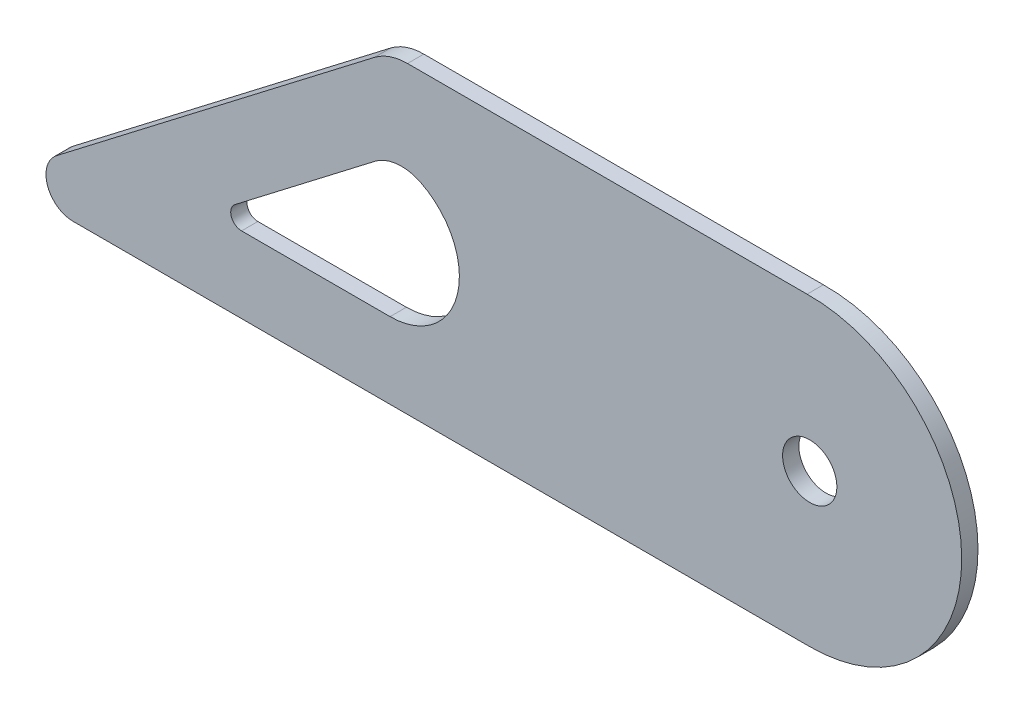
ISO-10303-21;
HEADER;
FILE_DESCRIPTION(('STEP AP214'),'2;1');
FILE_NAME('part.step','',(''),(''),'','','');
FILE_SCHEMA(('AUTOMOTIVE_DESIGN { 1 0 10303 214 1 1 1 1 }'));
ENDSEC;
DATA;
#1=APPLICATION_CONTEXT('core data for automotive mechanical design processes');
#2=APPLICATION_PROTOCOL_DEFINITION('international standard','automotive_design',2000,#1);
#3=PRODUCT_CONTEXT('',#1,'mechanical');
#4=PRODUCT('Part','Part','',(#3));
#5=PRODUCT_RELATED_PRODUCT_CATEGORY('part','',(#4));
#6=PRODUCT_DEFINITION_FORMATION('','',#4);
#7=PRODUCT_DEFINITION_CONTEXT('part definition',#1,'design');
#8=PRODUCT_DEFINITION('design','',#6,#7);
#9=PRODUCT_DEFINITION_SHAPE('','',#8);
#10=(LENGTH_UNIT() NAMED_UNIT(*) SI_UNIT(.MILLI.,.METRE.));
#11=(NAMED_UNIT(*) PLANE_ANGLE_UNIT() SI_UNIT($,.RADIAN.));
#12=(NAMED_UNIT(*) SI_UNIT($,.STERADIAN.) SOLID_ANGLE_UNIT());
#13=UNCERTAINTY_MEASURE_WITH_UNIT(LENGTH_MEASURE(1.E-05),#10,'distance_accuracy_value','');
#14=(GEOMETRIC_REPRESENTATION_CONTEXT(3) GLOBAL_UNCERTAINTY_ASSIGNED_CONTEXT((#13)) GLOBAL_UNIT_ASSIGNED_CONTEXT((#10,
#11,#12)) REPRESENTATION_CONTEXT('',''));
#15=CARTESIAN_POINT('',(0.,0.,0.));
#16=DIRECTION('',(0.,0.,1.));
#17=DIRECTION('',(1.,0.,0.));
#18=AXIS2_PLACEMENT_3D('',#15,#16,#17);
#19=CARTESIAN_POINT('',(2.43296484318195,-139.978857982453,7.5));
#20=DIRECTION('',(0.,0.,1.));
#21=DIRECTION('',(1.,0.,0.));
#22=AXIS2_PLACEMENT_3D('',#19,#20,#21);
#23=PLANE('',#22);
#24=CARTESIAN_POINT('',(-373.655156631983,-124.759495379133,7.5));
#25=DIRECTION('',(0.,0.,1.));
#26=DIRECTION('',(-1.,0.,0.));
#27=AXIS2_PLACEMENT_3D('',#24,#25,#26);
#28=CIRCLE('',#27,40.);
#29=CARTESIAN_POINT('',(-356.115398821638,-88.8101296551813,7.5));
#30=VERTEX_POINT('',#29);
#31=CARTESIAN_POINT('',(-398.014187586916,-93.0319425120013,7.5));
#32=VERTEX_POINT('',#31);
#33=EDGE_CURVE('E138',#30,#32,#28,.T.);
#34=ORIENTED_EDGE('',*,*,#33,.F.);
#35=CARTESIAN_POINT('',(-384.098122953556,-146.163326583456,7.5));
#36=DIRECTION('',(0.,0.,1.));
#37=DIRECTION('',(-1.,0.,0.));
#38=AXIS2_PLACEMENT_3D('',#35,#36,#37);
#39=CIRCLE('',#38,63.8155313989976);
#40=CARTESIAN_POINT('',(-384.098122953556,-209.978857982453,7.5));
#41=VERTEX_POINT('',#40);
#42=EDGE_CURVE('E129',#41,#30,#39,.T.);
#43=ORIENTED_EDGE('',*,*,#42,.F.);
#44=DIRECTION('',(1.,0.,0.));
#45=VECTOR('',#44,1.);
#46=CARTESIAN_POINT('',(-384.098122953556,-209.978857982453,7.5));
#47=LINE('',#46,#45);
#48=CARTESIAN_POINT('',(-520.891157533021,-209.978857982453,7.5));
#49=VERTEX_POINT('',#48);
#50=EDGE_CURVE('E163',#49,#41,#47,.T.);
#51=ORIENTED_EDGE('',*,*,#50,.F.);
#52=CARTESIAN_POINT('',(-520.891157533021,-199.978857982453,7.5));
#53=DIRECTION('',(0.,0.,1.));
#54=DIRECTION('',(1.,0.,0.));
#55=AXIS2_PLACEMENT_3D('',#52,#53,#54);
#56=CIRCLE('',#55,10.);
#57=CARTESIAN_POINT('',(-526.980915271754,-192.04696976567,7.5));
#58=VERTEX_POINT('',#57);
#59=EDGE_CURVE('E157',#58,#49,#56,.T.);
#60=ORIENTED_EDGE('',*,*,#59,.F.);
#61=DIRECTION('',(-0.793188821678298,-0.608975773873307,0.));
#62=VECTOR('',#61,1.);
#63=CARTESIAN_POINT('',(-526.980915271754,-192.04696976567,7.5));
#64=LINE('',#63,#62);
#65=EDGE_CURVE('E153',#32,#58,#64,.T.);
#66=ORIENTED_EDGE('',*,*,#65,.F.);
#67=EDGE_LOOP('',(#34,#43,#51,#60,#66));
#68=FACE_BOUND('',#67,.T.);
#69=CARTESIAN_POINT('',(2.43296484318195,-139.978857982453,7.5));
#70=DIRECTION('',(0.,0.,1.));
#71=DIRECTION('',(1.,0.,0.));
#72=AXIS2_PLACEMENT_3D('',#69,#70,#71);
#73=CIRCLE('',#72,140.);
#74=CARTESIAN_POINT('',(2.43296484318199,-279.978857982453,7.5));
#75=VERTEX_POINT('',#74);
#76=CARTESIAN_POINT('',(0.,0.,7.5));
#77=VERTEX_POINT('',#76);
#78=EDGE_CURVE('E191',#75,#77,#73,.T.);
#79=ORIENTED_EDGE('',*,*,#78,.T.);
#80=DIRECTION('',(-1.,0.,0.));
#81=VECTOR('',#80,1.);
#82=CARTESIAN_POINT('',(-368.019753232034,0.,7.5));
#83=LINE('',#82,#81);
#84=CARTESIAN_POINT('',(-368.019753232034,0.,7.5));
#85=VERTEX_POINT('',#84);
#86=EDGE_CURVE('E195',#77,#85,#83,.T.);
#87=ORIENTED_EDGE('',*,*,#86,.T.);
#88=CARTESIAN_POINT('',(-368.019753232034,-49.9999999999824,7.5));
#89=DIRECTION('',(0.,0.,1.));
#90=DIRECTION('',(1.,0.,0.));
#91=AXIS2_PLACEMENT_3D('',#88,#89,#90);
#92=CIRCLE('',#91,49.9999999999824);
#93=CARTESIAN_POINT('',(-398.468541925689,-10.3405589160815,7.5));
#94=VERTEX_POINT('',#93);
#95=EDGE_CURVE('E199',#85,#94,#92,.T.);
#96=ORIENTED_EDGE('',*,*,#95,.T.);
#97=DIRECTION('',(-0.793188821678298,-0.608975773873308,0.));
#98=VECTOR('',#97,1.);
#99=CARTESIAN_POINT('',(-398.468541925689,-10.3405589160815,7.5));
#100=LINE('',#99,#98);
#101=CARTESIAN_POINT('',(-691.280931438002,-235.149137440496,7.5));
#102=VERTEX_POINT('',#101);
#103=EDGE_CURVE('E202',#94,#102,#100,.T.);
#104=ORIENTED_EDGE('',*,*,#103,.T.);
#105=CARTESIAN_POINT('',(-676.05653709117,-254.978857982453,7.5));
#106=DIRECTION('',(0.,0.,1.));
#107=DIRECTION('',(1.,0.,0.));
#108=AXIS2_PLACEMENT_3D('',#105,#106,#107);
#109=CIRCLE('',#108,25.);
#110=CARTESIAN_POINT('',(-676.056537091171,-279.978857982453,7.5));
#111=VERTEX_POINT('',#110);
#112=EDGE_CURVE('E205',#102,#111,#109,.T.);
#113=ORIENTED_EDGE('',*,*,#112,.T.);
#114=DIRECTION('',(1.,0.,0.));
#115=VECTOR('',#114,1.);
#116=CARTESIAN_POINT('',(2.43296484318199,-279.978857982453,7.5));
#117=LINE('',#116,#115);
#118=EDGE_CURVE('E208',#111,#75,#117,.T.);
#119=ORIENTED_EDGE('',*,*,#118,.T.);
#120=EDGE_LOOP('',(#79,#87,#96,#104,#113,#119));
#121=FACE_BOUND('',#120,.T.);
#122=CARTESIAN_POINT('',(2.43296484318195,-139.978857982453,7.5));
#123=DIRECTION('',(0.,0.,1.));
#124=DIRECTION('',(1.,0.,0.));
#125=AXIS2_PLACEMENT_3D('',#122,#123,#124);
#126=CIRCLE('',#125,25.);
#127=CARTESIAN_POINT('',(27.432964843182,-139.978857982453,7.5));
#128=VERTEX_POINT('',#127);
#129=EDGE_CURVE('E168',#128,#128,#126,.T.);
#130=ORIENTED_EDGE('',*,*,#129,.F.);
#131=EDGE_LOOP('',(#130));
#132=FACE_BOUND('',#131,.T.);
#133=ADVANCED_FACE('F45',(#68,#121,#132),#23,.T.);
#134=CARTESIAN_POINT('',(2.43296484318195,-139.978857982453,-7.5));
#135=DIRECTION('',(0.,0.,1.));
#136=DIRECTION('',(1.,0.,0.));
#137=AXIS2_PLACEMENT_3D('',#134,#135,#136);
#138=PLANE('',#137);
#139=CARTESIAN_POINT('',(2.43296484318195,-139.978857982453,-7.5));
#140=DIRECTION('',(0.,0.,1.));
#141=DIRECTION('',(1.,0.,0.));
#142=AXIS2_PLACEMENT_3D('',#139,#140,#141);
#143=CIRCLE('',#142,140.);
#144=CARTESIAN_POINT('',(2.43296484318199,-279.978857982453,-7.5));
#145=VERTEX_POINT('',#144);
#146=CARTESIAN_POINT('',(0.,0.,-7.5));
#147=VERTEX_POINT('',#146);
#148=EDGE_CURVE('E147',#145,#147,#143,.T.);
#149=ORIENTED_EDGE('',*,*,#148,.F.);
#150=DIRECTION('',(1.,0.,0.));
#151=VECTOR('',#150,1.);
#152=CARTESIAN_POINT('',(2.43296484318199,-279.978857982453,-7.5));
#153=LINE('',#152,#151);
#154=CARTESIAN_POINT('',(-676.056537091171,-279.978857982453,-7.5));
#155=VERTEX_POINT('',#154);
#156=EDGE_CURVE('E196',#155,#145,#153,.T.);
#157=ORIENTED_EDGE('',*,*,#156,.F.);
#158=CARTESIAN_POINT('',(-676.05653709117,-254.978857982453,-7.5));
#159=DIRECTION('',(0.,0.,1.));
#160=DIRECTION('',(1.,0.,0.));
#161=AXIS2_PLACEMENT_3D('',#158,#159,#160);
#162=CIRCLE('',#161,25.);
#163=CARTESIAN_POINT('',(-691.280931438002,-235.149137440496,-7.5));
#164=VERTEX_POINT('',#163);
#165=EDGE_CURVE('E224',#164,#155,#162,.T.);
#166=ORIENTED_EDGE('',*,*,#165,.F.);
#167=DIRECTION('',(-0.793188821678298,-0.608975773873308,0.));
#168=VECTOR('',#167,1.);
#169=CARTESIAN_POINT('',(-398.468541925689,-10.3405589160815,-7.5));
#170=LINE('',#169,#168);
#171=CARTESIAN_POINT('',(-398.468541925689,-10.3405589160815,-7.5));
#172=VERTEX_POINT('',#171);
#173=EDGE_CURVE('E221',#172,#164,#170,.T.);
#174=ORIENTED_EDGE('',*,*,#173,.F.);
#175=CARTESIAN_POINT('',(-368.019753232034,-49.9999999999824,-7.5));
#176=DIRECTION('',(0.,0.,1.));
#177=DIRECTION('',(1.,0.,0.));
#178=AXIS2_PLACEMENT_3D('',#175,#176,#177);
#179=CIRCLE('',#178,49.9999999999824);
#180=CARTESIAN_POINT('',(-368.019753232034,0.,-7.5));
#181=VERTEX_POINT('',#180);
#182=EDGE_CURVE('E218',#181,#172,#179,.T.);
#183=ORIENTED_EDGE('',*,*,#182,.F.);
#184=DIRECTION('',(-1.,0.,0.));
#185=VECTOR('',#184,1.);
#186=CARTESIAN_POINT('',(-368.019753232034,0.,-7.5));
#187=LINE('',#186,#185);
#188=EDGE_CURVE('E215',#147,#181,#187,.T.);
#189=ORIENTED_EDGE('',*,*,#188,.F.);
#190=EDGE_LOOP('',(#149,#157,#166,#174,#183,#189));
#191=FACE_BOUND('',#190,.T.);
#192=CARTESIAN_POINT('',(-384.098122953556,-146.163326583456,-7.5));
#193=DIRECTION('',(0.,0.,1.));
#194=DIRECTION('',(-1.,0.,0.));
#195=AXIS2_PLACEMENT_3D('',#192,#193,#194);
#196=CIRCLE('',#195,63.8155313989976);
#197=CARTESIAN_POINT('',(-384.098122953556,-209.978857982453,-7.5));
#198=VERTEX_POINT('',#197);
#199=CARTESIAN_POINT('',(-356.115398821638,-88.8101296551813,-7.5));
#200=VERTEX_POINT('',#199);
#201=EDGE_CURVE('E69',#198,#200,#196,.T.);
#202=ORIENTED_EDGE('',*,*,#201,.T.);
#203=CARTESIAN_POINT('',(-373.655156631983,-124.759495379133,-7.5));
#204=DIRECTION('',(0.,0.,1.));
#205=DIRECTION('',(-1.,0.,0.));
#206=AXIS2_PLACEMENT_3D('',#203,#204,#205);
#207=CIRCLE('',#206,40.);
#208=CARTESIAN_POINT('',(-398.014187586916,-93.0319425120013,-7.5));
#209=VERTEX_POINT('',#208);
#210=EDGE_CURVE('E145',#200,#209,#207,.T.);
#211=ORIENTED_EDGE('',*,*,#210,.T.);
#212=DIRECTION('',(-0.793188821678298,-0.608975773873307,0.));
#213=VECTOR('',#212,1.);
#214=CARTESIAN_POINT('',(-526.980915271754,-192.04696976567,-7.5));
#215=LINE('',#214,#213);
#216=CARTESIAN_POINT('',(-526.980915271754,-192.04696976567,-7.5));
#217=VERTEX_POINT('',#216);
#218=EDGE_CURVE('E171',#209,#217,#215,.T.);
#219=ORIENTED_EDGE('',*,*,#218,.T.);
#220=CARTESIAN_POINT('',(-520.891157533021,-199.978857982453,-7.5));
#221=DIRECTION('',(0.,0.,1.));
#222=DIRECTION('',(1.,0.,0.));
#223=AXIS2_PLACEMENT_3D('',#220,#221,#222);
#224=CIRCLE('',#223,10.);
#225=CARTESIAN_POINT('',(-520.891157533021,-209.978857982453,-7.5));
#226=VERTEX_POINT('',#225);
#227=EDGE_CURVE('E175',#217,#226,#224,.T.);
#228=ORIENTED_EDGE('',*,*,#227,.T.);
#229=DIRECTION('',(1.,0.,0.));
#230=VECTOR('',#229,1.);
#231=CARTESIAN_POINT('',(-384.098122953556,-209.978857982453,-7.5));
#232=LINE('',#231,#230);
#233=EDGE_CURVE('E139',#226,#198,#232,.T.);
#234=ORIENTED_EDGE('',*,*,#233,.T.);
#235=EDGE_LOOP('',(#202,#211,#219,#228,#234));
#236=FACE_BOUND('',#235,.T.);
#237=CARTESIAN_POINT('',(2.43296484318195,-139.978857982453,-7.5));
#238=DIRECTION('',(0.,0.,1.));
#239=DIRECTION('',(1.,0.,0.));
#240=AXIS2_PLACEMENT_3D('',#237,#238,#239);
#241=CIRCLE('',#240,25.);
#242=CARTESIAN_POINT('',(27.432964843182,-139.978857982453,-7.5));
#243=VERTEX_POINT('',#242);
#244=EDGE_CURVE('E314',#243,#243,#241,.T.);
#245=ORIENTED_EDGE('',*,*,#244,.T.);
#246=EDGE_LOOP('',(#245));
#247=FACE_BOUND('',#246,.T.);
#248=ADVANCED_FACE('F255',(#191,#236,#247),#138,.F.);
#249=CARTESIAN_POINT('',(2.43296484318195,-139.978857982453,7.5));
#250=DIRECTION('',(0.,0.,-1.));
#251=DIRECTION('',(-1.,0.,0.));
#252=AXIS2_PLACEMENT_3D('',#249,#250,#251);
#253=CYLINDRICAL_SURFACE('',#252,140.);
#254=ORIENTED_EDGE('',*,*,#148,.T.);
#255=DIRECTION('',(0.,0.,-1.));
#256=VECTOR('',#255,1.);
#257=CARTESIAN_POINT('',(0.,0.,7.5));
#258=LINE('',#257,#256);
#259=EDGE_CURVE('E11',#77,#147,#258,.T.);
#260=ORIENTED_EDGE('',*,*,#259,.F.);
#261=ORIENTED_EDGE('',*,*,#78,.F.);
#262=DIRECTION('',(0.,0.,-1.));
#263=VECTOR('',#262,1.);
#264=CARTESIAN_POINT('',(2.43296484318199,-279.978857982453,7.5));
#265=LINE('',#264,#263);
#266=EDGE_CURVE('E211',#75,#145,#265,.T.);
#267=ORIENTED_EDGE('',*,*,#266,.T.);
#268=EDGE_LOOP('',(#254,#260,#261,#267));
#269=FACE_BOUND('',#268,.T.);
#270=ADVANCED_FACE('F47',(#269),#253,.T.);
#271=CARTESIAN_POINT('',(-368.019753232034,0.,7.5));
#272=DIRECTION('',(0.,-1.,0.));
#273=DIRECTION('',(1.,0.,0.));
#274=AXIS2_PLACEMENT_3D('',#271,#272,#273);
#275=PLANE('',#274);
#276=ORIENTED_EDGE('',*,*,#188,.T.);
#277=DIRECTION('',(0.,0.,-1.));
#278=VECTOR('',#277,1.);
#279=CARTESIAN_POINT('',(-368.019753232034,0.,7.5));
#280=LINE('',#279,#278);
#281=EDGE_CURVE('E54',#85,#181,#280,.T.);
#282=ORIENTED_EDGE('',*,*,#281,.F.);
#283=ORIENTED_EDGE('',*,*,#86,.F.);
#284=ORIENTED_EDGE('',*,*,#259,.T.);
#285=EDGE_LOOP('',(#276,#282,#283,#284));
#286=FACE_BOUND('',#285,.T.);
#287=ADVANCED_FACE('F272',(#286),#275,.F.);
#288=CARTESIAN_POINT('',(-368.019753232034,-49.9999999999824,7.5));
#289=DIRECTION('',(0.,0.,-1.));
#290=DIRECTION('',(-1.,0.,0.));
#291=AXIS2_PLACEMENT_3D('',#288,#289,#290);
#292=CYLINDRICAL_SURFACE('',#291,49.9999999999824);
#293=ORIENTED_EDGE('',*,*,#182,.T.);
#294=DIRECTION('',(0.,0.,-1.));
#295=VECTOR('',#294,1.);
#296=CARTESIAN_POINT('',(-398.468541925689,-10.3405589160815,7.5));
#297=LINE('',#296,#295);
#298=EDGE_CURVE('E240',#94,#172,#297,.T.);
#299=ORIENTED_EDGE('',*,*,#298,.F.);
#300=ORIENTED_EDGE('',*,*,#95,.F.);
#301=ORIENTED_EDGE('',*,*,#281,.T.);
#302=EDGE_LOOP('',(#293,#299,#300,#301));
#303=FACE_BOUND('',#302,.T.);
#304=ADVANCED_FACE('F249',(#303),#292,.T.);
#305=CARTESIAN_POINT('',(-398.468541925689,-10.3405589160815,7.5));
#306=DIRECTION('',(0.608975773873308,-0.793188821678298,0.));
#307=DIRECTION('',(0.793188821678298,0.608975773873308,0.));
#308=AXIS2_PLACEMENT_3D('',#305,#306,#307);
#309=PLANE('',#308);
#310=ORIENTED_EDGE('',*,*,#173,.T.);
#311=DIRECTION('',(0.,0.,-1.));
#312=VECTOR('',#311,1.);
#313=CARTESIAN_POINT('',(-691.280931438002,-235.149137440496,7.5));
#314=LINE('',#313,#312);
#315=EDGE_CURVE('E236',#102,#164,#314,.T.);
#316=ORIENTED_EDGE('',*,*,#315,.F.);
#317=ORIENTED_EDGE('',*,*,#103,.F.);
#318=ORIENTED_EDGE('',*,*,#298,.T.);
#319=EDGE_LOOP('',(#310,#316,#317,#318));
#320=FACE_BOUND('',#319,.T.);
#321=ADVANCED_FACE('F261',(#320),#309,.F.);
#322=CARTESIAN_POINT('',(-676.05653709117,-254.978857982453,7.5));
#323=DIRECTION('',(0.,0.,-1.));
#324=DIRECTION('',(-1.,0.,0.));
#325=AXIS2_PLACEMENT_3D('',#322,#323,#324);
#326=CYLINDRICAL_SURFACE('',#325,25.);
#327=ORIENTED_EDGE('',*,*,#165,.T.);
#328=DIRECTION('',(0.,0.,-1.));
#329=VECTOR('',#328,1.);
#330=CARTESIAN_POINT('',(-676.056537091171,-279.978857982453,7.5));
#331=LINE('',#330,#329);
#332=EDGE_CURVE('E232',#111,#155,#331,.T.);
#333=ORIENTED_EDGE('',*,*,#332,.F.);
#334=ORIENTED_EDGE('',*,*,#112,.F.);
#335=ORIENTED_EDGE('',*,*,#315,.T.);
#336=EDGE_LOOP('',(#327,#333,#334,#335));
#337=FACE_BOUND('',#336,.T.);
#338=ADVANCED_FACE('F265',(#337),#326,.T.);
#339=CARTESIAN_POINT('',(2.43296484318199,-279.978857982453,7.5));
#340=DIRECTION('',(0.,1.,0.));
#341=DIRECTION('',(-1.,0.,0.));
#342=AXIS2_PLACEMENT_3D('',#339,#340,#341);
#343=PLANE('',#342);
#344=ORIENTED_EDGE('',*,*,#156,.T.);
#345=ORIENTED_EDGE('',*,*,#266,.F.);
#346=ORIENTED_EDGE('',*,*,#118,.F.);
#347=ORIENTED_EDGE('',*,*,#332,.T.);
#348=EDGE_LOOP('',(#344,#345,#346,#347));
#349=FACE_BOUND('',#348,.T.);
#350=ADVANCED_FACE('F275',(#349),#343,.F.);
#351=CARTESIAN_POINT('',(-384.098122953556,-146.163326583456,7.5));
#352=DIRECTION('',(0.,0.,-1.));
#353=DIRECTION('',(-1.,0.,0.));
#354=AXIS2_PLACEMENT_3D('',#351,#352,#353);
#355=CYLINDRICAL_SURFACE('',#354,63.8155313989976);
#356=ORIENTED_EDGE('',*,*,#201,.F.);
#357=DIRECTION('',(0.,0.,-1.));
#358=VECTOR('',#357,1.);
#359=CARTESIAN_POINT('',(-384.098122953556,-209.978857982453,7.5));
#360=LINE('',#359,#358);
#361=EDGE_CURVE('E133',#41,#198,#360,.T.);
#362=ORIENTED_EDGE('',*,*,#361,.F.);
#363=ORIENTED_EDGE('',*,*,#42,.T.);
#364=DIRECTION('',(0.,0.,-1.));
#365=VECTOR('',#364,1.);
#366=CARTESIAN_POINT('',(-356.115398821638,-88.8101296551813,7.5));
#367=LINE('',#366,#365);
#368=EDGE_CURVE('E132',#30,#200,#367,.T.);
#369=ORIENTED_EDGE('',*,*,#368,.T.);
#370=EDGE_LOOP('',(#356,#362,#363,#369));
#371=FACE_BOUND('',#370,.T.);
#372=ADVANCED_FACE('F131',(#371),#355,.F.);
#373=CARTESIAN_POINT('',(-373.655156631983,-124.759495379133,7.5));
#374=DIRECTION('',(0.,0.,-1.));
#375=DIRECTION('',(-1.,0.,0.));
#376=AXIS2_PLACEMENT_3D('',#373,#374,#375);
#377=CYLINDRICAL_SURFACE('',#376,40.);
#378=ORIENTED_EDGE('',*,*,#210,.F.);
#379=ORIENTED_EDGE('',*,*,#368,.F.);
#380=ORIENTED_EDGE('',*,*,#33,.T.);
#381=DIRECTION('',(0.,0.,-1.));
#382=VECTOR('',#381,1.);
#383=CARTESIAN_POINT('',(-398.014187586916,-93.0319425120013,7.5));
#384=LINE('',#383,#382);
#385=EDGE_CURVE('E148',#32,#209,#384,.T.);
#386=ORIENTED_EDGE('',*,*,#385,.T.);
#387=EDGE_LOOP('',(#378,#379,#380,#386));
#388=FACE_BOUND('',#387,.T.);
#389=ADVANCED_FACE('F142',(#388),#377,.F.);
#390=CARTESIAN_POINT('',(-526.980915271754,-192.04696976567,7.5));
#391=DIRECTION('',(0.608975773873307,-0.793188821678298,0.));
#392=DIRECTION('',(0.793188821678298,0.608975773873307,0.));
#393=AXIS2_PLACEMENT_3D('',#390,#391,#392);
#394=PLANE('',#393);
#395=ORIENTED_EDGE('',*,*,#218,.F.);
#396=ORIENTED_EDGE('',*,*,#385,.F.);
#397=ORIENTED_EDGE('',*,*,#65,.T.);
#398=DIRECTION('',(0.,0.,-1.));
#399=VECTOR('',#398,1.);
#400=CARTESIAN_POINT('',(-526.980915271754,-192.04696976567,7.5));
#401=LINE('',#400,#399);
#402=EDGE_CURVE('E186',#58,#217,#401,.T.);
#403=ORIENTED_EDGE('',*,*,#402,.T.);
#404=EDGE_LOOP('',(#395,#396,#397,#403));
#405=FACE_BOUND('',#404,.T.);
#406=ADVANCED_FACE('F293',(#405),#394,.T.);
#407=CARTESIAN_POINT('',(-520.891157533021,-199.978857982453,7.5));
#408=DIRECTION('',(0.,0.,-1.));
#409=DIRECTION('',(-1.,0.,0.));
#410=AXIS2_PLACEMENT_3D('',#407,#408,#409);
#411=CYLINDRICAL_SURFACE('',#410,10.);
#412=ORIENTED_EDGE('',*,*,#227,.F.);
#413=ORIENTED_EDGE('',*,*,#402,.F.);
#414=ORIENTED_EDGE('',*,*,#59,.T.);
#415=DIRECTION('',(0.,0.,-1.));
#416=VECTOR('',#415,1.);
#417=CARTESIAN_POINT('',(-520.891157533021,-209.978857982453,7.5));
#418=LINE('',#417,#416);
#419=EDGE_CURVE('E61',#49,#226,#418,.T.);
#420=ORIENTED_EDGE('',*,*,#419,.T.);
#421=EDGE_LOOP('',(#412,#413,#414,#420));
#422=FACE_BOUND('',#421,.T.);
#423=ADVANCED_FACE('F296',(#422),#411,.F.);
#424=CARTESIAN_POINT('',(-384.098122953556,-209.978857982453,7.5));
#425=DIRECTION('',(0.,1.,0.));
#426=DIRECTION('',(-1.,0.,0.));
#427=AXIS2_PLACEMENT_3D('',#424,#425,#426);
#428=PLANE('',#427);
#429=ORIENTED_EDGE('',*,*,#233,.F.);
#430=ORIENTED_EDGE('',*,*,#419,.F.);
#431=ORIENTED_EDGE('',*,*,#50,.T.);
#432=ORIENTED_EDGE('',*,*,#361,.T.);
#433=EDGE_LOOP('',(#429,#430,#431,#432));
#434=FACE_BOUND('',#433,.T.);
#435=ADVANCED_FACE('F300',(#434),#428,.T.);
#436=CARTESIAN_POINT('',(2.43296484318195,-139.978857982453,7.5));
#437=DIRECTION('',(0.,0.,-1.));
#438=DIRECTION('',(-1.,0.,0.));
#439=AXIS2_PLACEMENT_3D('',#436,#437,#438);
#440=CYLINDRICAL_SURFACE('',#439,25.);
#441=ORIENTED_EDGE('',*,*,#129,.T.);
#442=EDGE_LOOP('',(#441));
#443=FACE_BOUND('',#442,.T.);
#444=ORIENTED_EDGE('',*,*,#244,.F.);
#445=EDGE_LOOP('',(#444));
#446=FACE_BOUND('',#445,.T.);
#447=ADVANCED_FACE('F304',(#443,#446),#440,.F.);
#448=CLOSED_SHELL('',(#133,#248,#270,#287,#304,#321,#338,#350,#372,#389,#406,#423,#435,#447));
#449=MANIFOLD_SOLID_BREP('B2',#448);
#450=ADVANCED_BREP_SHAPE_REPRESENTATION('',(#18,#449),#14);
#451=SHAPE_DEFINITION_REPRESENTATION(#9,#450);
ENDSEC;
END-ISO-10303-21;
